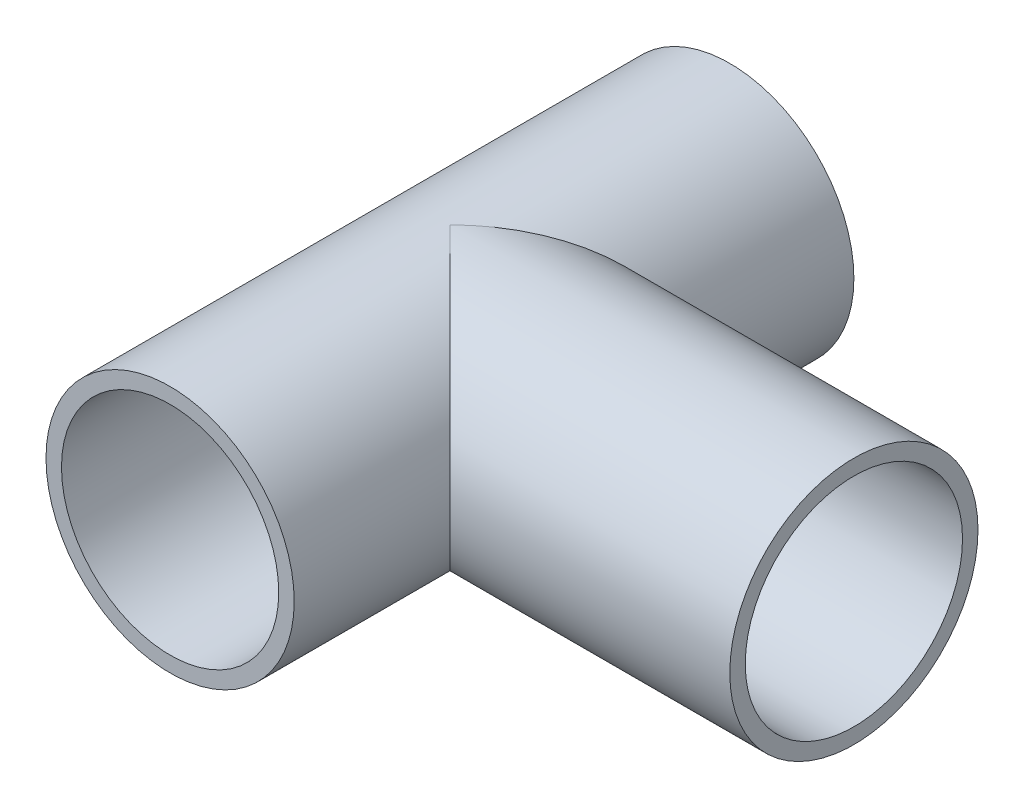
ISO-10303-21;
HEADER;
FILE_DESCRIPTION(('STEP AP214'),'2;1');
FILE_NAME('part.step','',(''),(''),'','','');
FILE_SCHEMA(('AUTOMOTIVE_DESIGN { 1 0 10303 214 1 1 1 1 }'));
ENDSEC;
DATA;
#1=APPLICATION_CONTEXT('core data for automotive mechanical design processes');
#2=APPLICATION_PROTOCOL_DEFINITION('international standard','automotive_design',2000,#1);
#3=PRODUCT_CONTEXT('',#1,'mechanical');
#4=PRODUCT('Part','Part','',(#3));
#5=PRODUCT_RELATED_PRODUCT_CATEGORY('part','',(#4));
#6=PRODUCT_DEFINITION_FORMATION('','',#4);
#7=PRODUCT_DEFINITION_CONTEXT('part definition',#1,'design');
#8=PRODUCT_DEFINITION('design','',#6,#7);
#9=PRODUCT_DEFINITION_SHAPE('','',#8);
#10=(LENGTH_UNIT() NAMED_UNIT(*) SI_UNIT(.MILLI.,.METRE.));
#11=(NAMED_UNIT(*) PLANE_ANGLE_UNIT() SI_UNIT($,.RADIAN.));
#12=(NAMED_UNIT(*) SI_UNIT($,.STERADIAN.) SOLID_ANGLE_UNIT());
#13=UNCERTAINTY_MEASURE_WITH_UNIT(LENGTH_MEASURE(1.E-05),#10,'distance_accuracy_value','');
#14=(GEOMETRIC_REPRESENTATION_CONTEXT(3) GLOBAL_UNCERTAINTY_ASSIGNED_CONTEXT((#13)) GLOBAL_UNIT_ASSIGNED_CONTEXT((#10,
#11,#12)) REPRESENTATION_CONTEXT('',''));
#15=CARTESIAN_POINT('',(0.,0.,0.));
#16=DIRECTION('',(0.,0.,1.));
#17=DIRECTION('',(1.,0.,0.));
#18=AXIS2_PLACEMENT_3D('',#15,#16,#17);
#19=CARTESIAN_POINT('',(0.,0.,365.125));
#20=DIRECTION('',(0.,0.,1.));
#21=DIRECTION('',(1.,0.,0.));
#22=AXIS2_PLACEMENT_3D('',#19,#20,#21);
#23=PLANE('',#22);
#24=CARTESIAN_POINT('',(0.,0.,365.125));
#25=DIRECTION('',(0.,0.,1.));
#26=DIRECTION('',(1.,0.,0.));
#27=AXIS2_PLACEMENT_3D('',#24,#25,#26);
#28=CIRCLE('',#27,161.925);
#29=CARTESIAN_POINT('',(161.925,0.,365.125));
#30=VERTEX_POINT('',#29);
#31=EDGE_CURVE('E11',#30,#30,#28,.T.);
#32=ORIENTED_EDGE('',*,*,#31,.T.);
#33=EDGE_LOOP('',(#32));
#34=FACE_BOUND('',#33,.T.);
#35=CARTESIAN_POINT('',(0.,0.,365.125));
#36=DIRECTION('',(0.,0.,1.));
#37=DIRECTION('',(1.,0.,0.));
#38=AXIS2_PLACEMENT_3D('',#35,#36,#37);
#39=CIRCLE('',#38,141.732);
#40=CARTESIAN_POINT('',(141.732,0.,365.125));
#41=VERTEX_POINT('',#40);
#42=EDGE_CURVE('E83',#41,#41,#39,.T.);
#43=ORIENTED_EDGE('',*,*,#42,.F.);
#44=EDGE_LOOP('',(#43));
#45=FACE_BOUND('',#44,.T.);
#46=ADVANCED_FACE('F39',(#34,#45),#23,.T.);
#47=CARTESIAN_POINT('',(0.,0.,-365.125));
#48=DIRECTION('',(0.,0.,1.));
#49=DIRECTION('',(1.,0.,0.));
#50=AXIS2_PLACEMENT_3D('',#47,#48,#49);
#51=PLANE('',#50);
#52=CARTESIAN_POINT('',(0.,0.,-365.125));
#53=DIRECTION('',(0.,0.,1.));
#54=DIRECTION('',(1.,0.,0.));
#55=AXIS2_PLACEMENT_3D('',#52,#53,#54);
#56=CIRCLE('',#55,161.925);
#57=CARTESIAN_POINT('',(161.925,0.,-365.125));
#58=VERTEX_POINT('',#57);
#59=EDGE_CURVE('E43',#58,#58,#56,.T.);
#60=ORIENTED_EDGE('',*,*,#59,.F.);
#61=EDGE_LOOP('',(#60));
#62=FACE_BOUND('',#61,.T.);
#63=CARTESIAN_POINT('',(0.,0.,-365.125));
#64=DIRECTION('',(0.,0.,1.));
#65=DIRECTION('',(1.,0.,0.));
#66=AXIS2_PLACEMENT_3D('',#63,#64,#65);
#67=CIRCLE('',#66,141.732);
#68=CARTESIAN_POINT('',(141.732,0.,-365.125));
#69=VERTEX_POINT('',#68);
#70=EDGE_CURVE('E81',#69,#69,#67,.T.);
#71=ORIENTED_EDGE('',*,*,#70,.T.);
#72=EDGE_LOOP('',(#71));
#73=FACE_BOUND('',#72,.T.);
#74=ADVANCED_FACE('F89',(#62,#73),#51,.F.);
#75=CARTESIAN_POINT('',(0.,0.,365.125));
#76=DIRECTION('',(0.,0.,-1.));
#77=DIRECTION('',(-1.,0.,0.));
#78=AXIS2_PLACEMENT_3D('',#75,#76,#77);
#79=CYLINDRICAL_SURFACE('',#78,161.925);
#80=CARTESIAN_POINT('',(0.,0.,0.));
#81=DIRECTION('',(0.707106781186547,0.,0.707106781186547));
#82=DIRECTION('',(0.707106781186547,0.,-0.707106781186547));
#83=AXIS2_PLACEMENT_3D('',#80,#81,#82);
#84=ELLIPSE('',#83,228.996531087264,161.925);
#85=CARTESIAN_POINT('',(0.,-161.925,0.));
#86=VERTEX_POINT('',#85);
#87=CARTESIAN_POINT('',(0.,161.925,0.));
#88=VERTEX_POINT('',#87);
#89=EDGE_CURVE('E73',#86,#88,#84,.T.);
#90=ORIENTED_EDGE('',*,*,#89,.F.);
#91=CARTESIAN_POINT('',(0.,0.,0.));
#92=DIRECTION('',(0.707106781186547,0.,-0.707106781186547));
#93=DIRECTION('',(0.707106781186547,0.,0.707106781186547));
#94=AXIS2_PLACEMENT_3D('',#91,#92,#93);
#95=ELLIPSE('',#94,228.996531087264,161.925);
#96=EDGE_CURVE('E60',#88,#86,#95,.T.);
#97=ORIENTED_EDGE('',*,*,#96,.F.);
#98=EDGE_LOOP('',(#90,#97));
#99=FACE_BOUND('',#98,.T.);
#100=ORIENTED_EDGE('',*,*,#31,.F.);
#101=EDGE_LOOP('',(#100));
#102=FACE_BOUND('',#101,.T.);
#103=ORIENTED_EDGE('',*,*,#59,.T.);
#104=EDGE_LOOP('',(#103));
#105=FACE_BOUND('',#104,.T.);
#106=ADVANCED_FACE('F41',(#99,#102,#105),#79,.T.);
#107=CARTESIAN_POINT('',(0.,0.,365.125));
#108=DIRECTION('',(0.,0.,-1.));
#109=DIRECTION('',(-1.,0.,0.));
#110=AXIS2_PLACEMENT_3D('',#107,#108,#109);
#111=CYLINDRICAL_SURFACE('',#110,141.732);
#112=CARTESIAN_POINT('',(0.,0.,0.));
#113=DIRECTION('',(0.707106781186547,0.,-0.707106781186547));
#114=DIRECTION('',(-0.707106781186547,0.,-0.707106781186547));
#115=AXIS2_PLACEMENT_3D('',#112,#113,#114);
#116=ELLIPSE('',#115,200.439316622264,141.732);
#117=CARTESIAN_POINT('',(0.,-141.732,0.));
#118=VERTEX_POINT('',#117);
#119=CARTESIAN_POINT('',(0.,141.732,0.));
#120=VERTEX_POINT('',#119);
#121=EDGE_CURVE('E53',#118,#120,#116,.F.);
#122=ORIENTED_EDGE('',*,*,#121,.F.);
#123=CARTESIAN_POINT('',(0.,0.,0.));
#124=DIRECTION('',(-0.707106781186547,0.,-0.707106781186547));
#125=DIRECTION('',(0.707106781186547,0.,-0.707106781186547));
#126=AXIS2_PLACEMENT_3D('',#123,#124,#125);
#127=ELLIPSE('',#126,200.439316622264,141.732);
#128=EDGE_CURVE('E65',#120,#118,#127,.T.);
#129=ORIENTED_EDGE('',*,*,#128,.F.);
#130=EDGE_LOOP('',(#122,#129));
#131=FACE_BOUND('',#130,.T.);
#132=ORIENTED_EDGE('',*,*,#42,.T.);
#133=EDGE_LOOP('',(#132));
#134=FACE_BOUND('',#133,.T.);
#135=ORIENTED_EDGE('',*,*,#70,.F.);
#136=EDGE_LOOP('',(#135));
#137=FACE_BOUND('',#136,.T.);
#138=ADVANCED_FACE('F71',(#131,#134,#137),#111,.F.);
#139=CARTESIAN_POINT('',(-161.926,0.,0.));
#140=DIRECTION('',(1.,0.,0.));
#141=DIRECTION('',(0.,0.,-1.));
#142=AXIS2_PLACEMENT_3D('',#139,#140,#141);
#143=CYLINDRICAL_SURFACE('',#142,161.925);
#144=CARTESIAN_POINT('',(527.05,0.,0.));
#145=DIRECTION('',(1.,0.,0.));
#146=DIRECTION('',(0.,0.,-1.));
#147=AXIS2_PLACEMENT_3D('',#144,#145,#146);
#148=CIRCLE('',#147,161.925);
#149=CARTESIAN_POINT('',(527.05,0.,-161.925));
#150=VERTEX_POINT('',#149);
#151=EDGE_CURVE('E79',#150,#150,#148,.T.);
#152=ORIENTED_EDGE('',*,*,#151,.F.);
#153=EDGE_LOOP('',(#152));
#154=FACE_BOUND('',#153,.T.);
#155=ORIENTED_EDGE('',*,*,#89,.T.);
#156=ORIENTED_EDGE('',*,*,#96,.T.);
#157=EDGE_LOOP('',(#155,#156));
#158=FACE_BOUND('',#157,.T.);
#159=ADVANCED_FACE('F92',(#154,#158),#143,.T.);
#160=CARTESIAN_POINT('',(527.05,0.,0.));
#161=DIRECTION('',(1.,0.,0.));
#162=DIRECTION('',(0.,0.,-1.));
#163=AXIS2_PLACEMENT_3D('',#160,#161,#162);
#164=PLANE('',#163);
#165=CARTESIAN_POINT('',(527.05,0.,0.));
#166=DIRECTION('',(1.,0.,0.));
#167=DIRECTION('',(0.,0.,-1.));
#168=AXIS2_PLACEMENT_3D('',#165,#166,#167);
#169=CIRCLE('',#168,141.732);
#170=CARTESIAN_POINT('',(527.05,0.,-141.732));
#171=VERTEX_POINT('',#170);
#172=EDGE_CURVE('E69',#171,#171,#169,.T.);
#173=ORIENTED_EDGE('',*,*,#172,.F.);
#174=EDGE_LOOP('',(#173));
#175=FACE_BOUND('',#174,.T.);
#176=ORIENTED_EDGE('',*,*,#151,.T.);
#177=EDGE_LOOP('',(#176));
#178=FACE_BOUND('',#177,.T.);
#179=ADVANCED_FACE('F98',(#175,#178),#164,.T.);
#180=CARTESIAN_POINT('',(-400.878633244527,0.,0.));
#181=DIRECTION('',(1.,0.,0.));
#182=DIRECTION('',(0.,0.,-1.));
#183=AXIS2_PLACEMENT_3D('',#180,#181,#182);
#184=CYLINDRICAL_SURFACE('',#183,141.732);
#185=ORIENTED_EDGE('',*,*,#121,.T.);
#186=ORIENTED_EDGE('',*,*,#128,.T.);
#187=EDGE_LOOP('',(#185,#186));
#188=FACE_BOUND('',#187,.T.);
#189=ORIENTED_EDGE('',*,*,#172,.T.);
#190=EDGE_LOOP('',(#189));
#191=FACE_BOUND('',#190,.T.);
#192=ADVANCED_FACE('F66',(#188,#191),#184,.F.);
#193=CLOSED_SHELL('',(#46,#74,#106,#138,#159,#179,#192));
#194=MANIFOLD_SOLID_BREP('B2',#193);
#195=ADVANCED_BREP_SHAPE_REPRESENTATION('',(#18,#194),#14);
#196=SHAPE_DEFINITION_REPRESENTATION(#9,#195);
ENDSEC;
END-ISO-10303-21;
